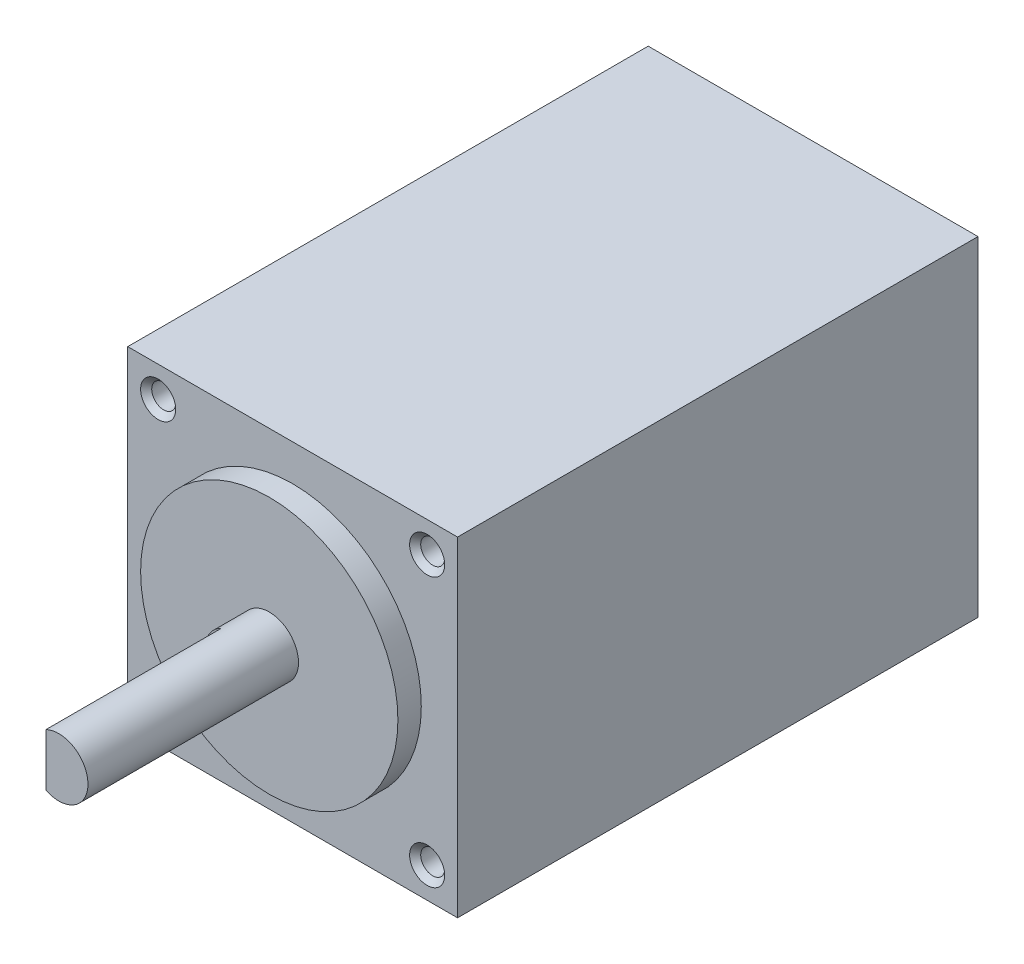
ISO-10303-21;
HEADER;
FILE_DESCRIPTION(('STEP AP214'),'2;1');
FILE_NAME('part.step','',(''),(''),'','','');
FILE_SCHEMA(('AUTOMOTIVE_DESIGN { 1 0 10303 214 1 1 1 1 }'));
ENDSEC;
DATA;
#1=APPLICATION_CONTEXT('core data for automotive mechanical design processes');
#2=APPLICATION_PROTOCOL_DEFINITION('international standard','automotive_design',2000,#1);
#3=PRODUCT_CONTEXT('',#1,'mechanical');
#4=PRODUCT('Part','Part','',(#3));
#5=PRODUCT_RELATED_PRODUCT_CATEGORY('part','',(#4));
#6=PRODUCT_DEFINITION_FORMATION('','',#4);
#7=PRODUCT_DEFINITION_CONTEXT('part definition',#1,'design');
#8=PRODUCT_DEFINITION('design','',#6,#7);
#9=PRODUCT_DEFINITION_SHAPE('','',#8);
#10=(LENGTH_UNIT() NAMED_UNIT(*) SI_UNIT(.MILLI.,.METRE.));
#11=(NAMED_UNIT(*) PLANE_ANGLE_UNIT() SI_UNIT($,.RADIAN.));
#12=(NAMED_UNIT(*) SI_UNIT($,.STERADIAN.) SOLID_ANGLE_UNIT());
#13=UNCERTAINTY_MEASURE_WITH_UNIT(LENGTH_MEASURE(1.E-05),#10,'distance_accuracy_value','');
#14=(GEOMETRIC_REPRESENTATION_CONTEXT(3) GLOBAL_UNCERTAINTY_ASSIGNED_CONTEXT((#13)) GLOBAL_UNIT_ASSIGNED_CONTEXT((#10,
#11,#12)) REPRESENTATION_CONTEXT('',''));
#15=CARTESIAN_POINT('',(0.,0.,0.));
#16=DIRECTION('',(0.,0.,1.));
#17=DIRECTION('',(1.,0.,0.));
#18=AXIS2_PLACEMENT_3D('',#15,#16,#17);
#19=CARTESIAN_POINT('',(0.,0.,44.5));
#20=DIRECTION('',(1.,0.,0.));
#21=DIRECTION('',(0.,0.,-1.));
#22=AXIS2_PLACEMENT_3D('',#19,#20,#21);
#23=PLANE('',#22);
#24=DIRECTION('',(0.,-1.,0.));
#25=VECTOR('',#24,1.);
#26=CARTESIAN_POINT('',(0.,0.,0.));
#27=LINE('',#26,#25);
#28=CARTESIAN_POINT('',(0.,28.2,0.));
#29=VERTEX_POINT('',#28);
#30=CARTESIAN_POINT('',(0.,0.,0.));
#31=VERTEX_POINT('',#30);
#32=EDGE_CURVE('E178',#29,#31,#27,.T.);
#33=ORIENTED_EDGE('',*,*,#32,.T.);
#34=DIRECTION('',(0.,0.,-1.));
#35=VECTOR('',#34,1.);
#36=CARTESIAN_POINT('',(0.,0.,44.5));
#37=LINE('',#36,#35);
#38=CARTESIAN_POINT('',(0.,0.,44.5));
#39=VERTEX_POINT('',#38);
#40=EDGE_CURVE('E48',#39,#31,#37,.T.);
#41=ORIENTED_EDGE('',*,*,#40,.F.);
#42=DIRECTION('',(0.,-1.,0.));
#43=VECTOR('',#42,1.);
#44=CARTESIAN_POINT('',(0.,0.,44.5));
#45=LINE('',#44,#43);
#46=CARTESIAN_POINT('',(0.,28.2,44.5));
#47=VERTEX_POINT('',#46);
#48=EDGE_CURVE('E179',#47,#39,#45,.T.);
#49=ORIENTED_EDGE('',*,*,#48,.F.);
#50=DIRECTION('',(0.,0.,-1.));
#51=VECTOR('',#50,1.);
#52=CARTESIAN_POINT('',(0.,28.2,44.5));
#53=LINE('',#52,#51);
#54=EDGE_CURVE('E185',#47,#29,#53,.T.);
#55=ORIENTED_EDGE('',*,*,#54,.T.);
#56=EDGE_LOOP('',(#33,#41,#49,#55));
#57=FACE_BOUND('',#56,.T.);
#58=ADVANCED_FACE('F41',(#57),#23,.F.);
#59=CARTESIAN_POINT('',(0.,0.,44.5));
#60=DIRECTION('',(0.,1.,0.));
#61=DIRECTION('',(0.,0.,1.));
#62=AXIS2_PLACEMENT_3D('',#59,#60,#61);
#63=PLANE('',#62);
#64=DIRECTION('',(1.,0.,0.));
#65=VECTOR('',#64,1.);
#66=CARTESIAN_POINT('',(0.,0.,0.));
#67=LINE('',#66,#65);
#68=CARTESIAN_POINT('',(28.2,0.,0.));
#69=VERTEX_POINT('',#68);
#70=EDGE_CURVE('E188',#31,#69,#67,.T.);
#71=ORIENTED_EDGE('',*,*,#70,.T.);
#72=DIRECTION('',(0.,0.,-1.));
#73=VECTOR('',#72,1.);
#74=CARTESIAN_POINT('',(28.2,0.,44.5));
#75=LINE('',#74,#73);
#76=CARTESIAN_POINT('',(28.2,0.,44.5));
#77=VERTEX_POINT('',#76);
#78=EDGE_CURVE('E196',#77,#69,#75,.T.);
#79=ORIENTED_EDGE('',*,*,#78,.F.);
#80=DIRECTION('',(1.,0.,0.));
#81=VECTOR('',#80,1.);
#82=CARTESIAN_POINT('',(0.,0.,44.5));
#83=LINE('',#82,#81);
#84=EDGE_CURVE('E93',#39,#77,#83,.T.);
#85=ORIENTED_EDGE('',*,*,#84,.F.);
#86=ORIENTED_EDGE('',*,*,#40,.T.);
#87=EDGE_LOOP('',(#71,#79,#85,#86));
#88=FACE_BOUND('',#87,.T.);
#89=ADVANCED_FACE('F199',(#88),#63,.F.);
#90=CARTESIAN_POINT('',(28.2,0.,44.5));
#91=DIRECTION('',(-1.,0.,0.));
#92=DIRECTION('',(0.,0.,1.));
#93=AXIS2_PLACEMENT_3D('',#90,#91,#92);
#94=PLANE('',#93);
#95=DIRECTION('',(0.,1.,0.));
#96=VECTOR('',#95,1.);
#97=CARTESIAN_POINT('',(28.2,0.,0.));
#98=LINE('',#97,#96);
#99=CARTESIAN_POINT('',(28.2,28.2,0.));
#100=VERTEX_POINT('',#99);
#101=EDGE_CURVE('E190',#69,#100,#98,.T.);
#102=ORIENTED_EDGE('',*,*,#101,.T.);
#103=DIRECTION('',(0.,0.,-1.));
#104=VECTOR('',#103,1.);
#105=CARTESIAN_POINT('',(28.2,28.2,44.5));
#106=LINE('',#105,#104);
#107=CARTESIAN_POINT('',(28.2,28.2,44.5));
#108=VERTEX_POINT('',#107);
#109=EDGE_CURVE('E194',#108,#100,#106,.T.);
#110=ORIENTED_EDGE('',*,*,#109,.F.);
#111=DIRECTION('',(0.,1.,0.));
#112=VECTOR('',#111,1.);
#113=CARTESIAN_POINT('',(28.2,0.,44.5));
#114=LINE('',#113,#112);
#115=EDGE_CURVE('E182',#77,#108,#114,.T.);
#116=ORIENTED_EDGE('',*,*,#115,.F.);
#117=ORIENTED_EDGE('',*,*,#78,.T.);
#118=EDGE_LOOP('',(#102,#110,#116,#117));
#119=FACE_BOUND('',#118,.T.);
#120=ADVANCED_FACE('F208',(#119),#94,.F.);
#121=CARTESIAN_POINT('',(0.,28.2,44.5));
#122=DIRECTION('',(0.,-1.,0.));
#123=DIRECTION('',(1.,0.,0.));
#124=AXIS2_PLACEMENT_3D('',#121,#122,#123);
#125=PLANE('',#124);
#126=DIRECTION('',(-1.,0.,0.));
#127=VECTOR('',#126,1.);
#128=CARTESIAN_POINT('',(0.,28.2,0.));
#129=LINE('',#128,#127);
#130=EDGE_CURVE('E85',#100,#29,#129,.T.);
#131=ORIENTED_EDGE('',*,*,#130,.T.);
#132=ORIENTED_EDGE('',*,*,#54,.F.);
#133=DIRECTION('',(-1.,0.,0.));
#134=VECTOR('',#133,1.);
#135=CARTESIAN_POINT('',(0.,28.2,44.5));
#136=LINE('',#135,#134);
#137=EDGE_CURVE('E64',#108,#47,#136,.T.);
#138=ORIENTED_EDGE('',*,*,#137,.F.);
#139=ORIENTED_EDGE('',*,*,#109,.T.);
#140=EDGE_LOOP('',(#131,#132,#138,#139));
#141=FACE_BOUND('',#140,.T.);
#142=ADVANCED_FACE('F210',(#141),#125,.F.);
#143=CARTESIAN_POINT('',(0.,0.,44.5));
#144=DIRECTION('',(0.,0.,-1.));
#145=DIRECTION('',(-1.,0.,0.));
#146=AXIS2_PLACEMENT_3D('',#143,#144,#145);
#147=PLANE('',#146);
#148=CARTESIAN_POINT('',(14.1,14.1,44.5));
#149=DIRECTION('',(0.,0.,-1.));
#150=DIRECTION('',(-1.,0.,0.));
#151=AXIS2_PLACEMENT_3D('',#148,#149,#150);
#152=CIRCLE('',#151,11.);
#153=CARTESIAN_POINT('',(3.1,14.1,44.5));
#154=VERTEX_POINT('',#153);
#155=EDGE_CURVE('E11',#154,#154,#152,.F.);
#156=ORIENTED_EDGE('',*,*,#155,.F.);
#157=EDGE_LOOP('',(#156));
#158=FACE_BOUND('',#157,.T.);
#159=CARTESIAN_POINT('',(25.5999999999999,25.5999999999999,44.5));
#160=DIRECTION('',(0.,0.,1.));
#161=DIRECTION('',(1.,0.,0.));
#162=AXIS2_PLACEMENT_3D('',#159,#160,#161);
#163=CIRCLE('',#162,1.5);
#164=CARTESIAN_POINT('',(27.0999999999999,25.5999999999999,44.5));
#165=VERTEX_POINT('',#164);
#166=EDGE_CURVE('E142',#165,#165,#163,.T.);
#167=ORIENTED_EDGE('',*,*,#166,.F.);
#168=EDGE_LOOP('',(#167));
#169=FACE_BOUND('',#168,.T.);
#170=CARTESIAN_POINT('',(2.59999999999988,2.59999999999988,44.5));
#171=DIRECTION('',(0.,0.,1.));
#172=DIRECTION('',(1.,0.,0.));
#173=AXIS2_PLACEMENT_3D('',#170,#171,#172);
#174=CIRCLE('',#173,1.5);
#175=CARTESIAN_POINT('',(4.09999999999988,2.59999999999988,44.5));
#176=VERTEX_POINT('',#175);
#177=EDGE_CURVE('E151',#176,#176,#174,.T.);
#178=ORIENTED_EDGE('',*,*,#177,.F.);
#179=EDGE_LOOP('',(#178));
#180=FACE_BOUND('',#179,.T.);
#181=CARTESIAN_POINT('',(2.59999999999988,25.5999999999999,44.5));
#182=DIRECTION('',(0.,0.,1.));
#183=DIRECTION('',(1.,0.,0.));
#184=AXIS2_PLACEMENT_3D('',#181,#182,#183);
#185=CIRCLE('',#184,1.5);
#186=CARTESIAN_POINT('',(4.09999999999988,25.5999999999999,44.5));
#187=VERTEX_POINT('',#186);
#188=EDGE_CURVE('E160',#187,#187,#185,.T.);
#189=ORIENTED_EDGE('',*,*,#188,.F.);
#190=EDGE_LOOP('',(#189));
#191=FACE_BOUND('',#190,.T.);
#192=CARTESIAN_POINT('',(25.5999999999999,2.59999999999988,44.5));
#193=DIRECTION('',(0.,0.,1.));
#194=DIRECTION('',(1.,0.,0.));
#195=AXIS2_PLACEMENT_3D('',#192,#193,#194);
#196=CIRCLE('',#195,1.5);
#197=CARTESIAN_POINT('',(27.0999999999999,2.59999999999988,44.5));
#198=VERTEX_POINT('',#197);
#199=EDGE_CURVE('E169',#198,#198,#196,.T.);
#200=ORIENTED_EDGE('',*,*,#199,.F.);
#201=EDGE_LOOP('',(#200));
#202=FACE_BOUND('',#201,.T.);
#203=ORIENTED_EDGE('',*,*,#48,.T.);
#204=ORIENTED_EDGE('',*,*,#84,.T.);
#205=ORIENTED_EDGE('',*,*,#115,.T.);
#206=ORIENTED_EDGE('',*,*,#137,.T.);
#207=EDGE_LOOP('',(#203,#204,#205,#206));
#208=FACE_BOUND('',#207,.T.);
#209=ADVANCED_FACE('F211',(#158,#169,#180,#191,#202,#208),#147,.F.);
#210=CARTESIAN_POINT('',(0.,0.,0.));
#211=DIRECTION('',(0.,0.,-1.));
#212=DIRECTION('',(-1.,0.,0.));
#213=AXIS2_PLACEMENT_3D('',#210,#211,#212);
#214=PLANE('',#213);
#215=ORIENTED_EDGE('',*,*,#32,.F.);
#216=ORIENTED_EDGE('',*,*,#130,.F.);
#217=ORIENTED_EDGE('',*,*,#101,.F.);
#218=ORIENTED_EDGE('',*,*,#70,.F.);
#219=EDGE_LOOP('',(#215,#216,#217,#218));
#220=FACE_BOUND('',#219,.T.);
#221=ADVANCED_FACE('F204',(#220),#214,.T.);
#222=CARTESIAN_POINT('',(25.5999999999999,2.59999999999988,38.1));
#223=DIRECTION('',(0.,0.,1.));
#224=DIRECTION('',(1.,0.,0.));
#225=AXIS2_PLACEMENT_3D('',#222,#223,#224);
#226=CONICAL_SURFACE('',#225,1.02499999999998,1.02974425867664);
#227=CARTESIAN_POINT('',(25.5999999999999,2.59999999999988,37.4841178654967));
#228=VERTEX_POINT('',#227);
#229=VERTEX_LOOP('',#228);
#230=FACE_BOUND('',#229,.T.);
#231=CARTESIAN_POINT('',(25.5999999999999,2.59999999999988,38.1));
#232=DIRECTION('',(0.,0.,1.));
#233=DIRECTION('',(1.,0.,0.));
#234=AXIS2_PLACEMENT_3D('',#231,#232,#233);
#235=CIRCLE('',#234,1.02499999999998);
#236=CARTESIAN_POINT('',(26.6249999999999,2.59999999999988,38.1));
#237=VERTEX_POINT('',#236);
#238=EDGE_CURVE('E175',#237,#237,#235,.T.);
#239=ORIENTED_EDGE('',*,*,#238,.T.);
#240=EDGE_LOOP('',(#239));
#241=FACE_BOUND('',#240,.T.);
#242=ADVANCED_FACE('F220',(#230,#241),#226,.F.);
#243=CARTESIAN_POINT('',(25.5999999999999,2.59999999999988,44.5));
#244=DIRECTION('',(0.,0.,1.));
#245=DIRECTION('',(1.,0.,0.));
#246=AXIS2_PLACEMENT_3D('',#243,#244,#245);
#247=CYLINDRICAL_SURFACE('',#246,1.02499999999999);
#248=ORIENTED_EDGE('',*,*,#238,.F.);
#249=EDGE_LOOP('',(#248));
#250=FACE_BOUND('',#249,.T.);
#251=CARTESIAN_POINT('',(25.5999999999999,2.59999999999988,44.025));
#252=DIRECTION('',(0.,0.,1.));
#253=DIRECTION('',(1.,0.,0.));
#254=AXIS2_PLACEMENT_3D('',#251,#252,#253);
#255=CIRCLE('',#254,1.025);
#256=CARTESIAN_POINT('',(26.6249999999999,2.59999999999988,44.025));
#257=VERTEX_POINT('',#256);
#258=EDGE_CURVE('E172',#257,#257,#255,.T.);
#259=ORIENTED_EDGE('',*,*,#258,.T.);
#260=EDGE_LOOP('',(#259));
#261=FACE_BOUND('',#260,.T.);
#262=ADVANCED_FACE('F268',(#250,#261),#247,.F.);
#263=CARTESIAN_POINT('',(25.5999999999999,2.59999999999988,44.5));
#264=DIRECTION('',(0.,0.,1.));
#265=DIRECTION('',(1.,0.,0.));
#266=AXIS2_PLACEMENT_3D('',#263,#264,#265);
#267=CONICAL_SURFACE('',#266,1.5,0.785398163397448);
#268=ORIENTED_EDGE('',*,*,#258,.F.);
#269=EDGE_LOOP('',(#268));
#270=FACE_BOUND('',#269,.T.);
#271=ORIENTED_EDGE('',*,*,#199,.T.);
#272=EDGE_LOOP('',(#271));
#273=FACE_BOUND('',#272,.T.);
#274=ADVANCED_FACE('F263',(#270,#273),#267,.F.);
#275=CARTESIAN_POINT('',(2.59999999999988,25.5999999999999,38.1));
#276=DIRECTION('',(0.,0.,1.));
#277=DIRECTION('',(1.,0.,0.));
#278=AXIS2_PLACEMENT_3D('',#275,#276,#277);
#279=CONICAL_SURFACE('',#278,1.02499999999998,1.02974425867664);
#280=CARTESIAN_POINT('',(2.59999999999988,25.5999999999999,37.4841178654967));
#281=VERTEX_POINT('',#280);
#282=VERTEX_LOOP('',#281);
#283=FACE_BOUND('',#282,.T.);
#284=CARTESIAN_POINT('',(2.59999999999988,25.5999999999999,38.1));
#285=DIRECTION('',(0.,0.,1.));
#286=DIRECTION('',(1.,0.,0.));
#287=AXIS2_PLACEMENT_3D('',#284,#285,#286);
#288=CIRCLE('',#287,1.02499999999998);
#289=CARTESIAN_POINT('',(3.62499999999986,25.5999999999999,38.1));
#290=VERTEX_POINT('',#289);
#291=EDGE_CURVE('E166',#290,#290,#288,.T.);
#292=ORIENTED_EDGE('',*,*,#291,.T.);
#293=EDGE_LOOP('',(#292));
#294=FACE_BOUND('',#293,.T.);
#295=ADVANCED_FACE('F267',(#283,#294),#279,.F.);
#296=CARTESIAN_POINT('',(2.59999999999988,25.5999999999999,44.5));
#297=DIRECTION('',(0.,0.,1.));
#298=DIRECTION('',(1.,0.,0.));
#299=AXIS2_PLACEMENT_3D('',#296,#297,#298);
#300=CYLINDRICAL_SURFACE('',#299,1.02499999999999);
#301=ORIENTED_EDGE('',*,*,#291,.F.);
#302=EDGE_LOOP('',(#301));
#303=FACE_BOUND('',#302,.T.);
#304=CARTESIAN_POINT('',(2.59999999999988,25.5999999999999,44.025));
#305=DIRECTION('',(0.,0.,1.));
#306=DIRECTION('',(1.,0.,0.));
#307=AXIS2_PLACEMENT_3D('',#304,#305,#306);
#308=CIRCLE('',#307,1.025);
#309=CARTESIAN_POINT('',(3.62499999999988,25.5999999999999,44.025));
#310=VERTEX_POINT('',#309);
#311=EDGE_CURVE('E163',#310,#310,#308,.T.);
#312=ORIENTED_EDGE('',*,*,#311,.T.);
#313=EDGE_LOOP('',(#312));
#314=FACE_BOUND('',#313,.T.);
#315=ADVANCED_FACE('F292',(#303,#314),#300,.F.);
#316=CARTESIAN_POINT('',(2.59999999999988,25.5999999999999,44.5));
#317=DIRECTION('',(0.,0.,1.));
#318=DIRECTION('',(1.,0.,0.));
#319=AXIS2_PLACEMENT_3D('',#316,#317,#318);
#320=CONICAL_SURFACE('',#319,1.5,0.785398163397446);
#321=ORIENTED_EDGE('',*,*,#311,.F.);
#322=EDGE_LOOP('',(#321));
#323=FACE_BOUND('',#322,.T.);
#324=ORIENTED_EDGE('',*,*,#188,.T.);
#325=EDGE_LOOP('',(#324));
#326=FACE_BOUND('',#325,.T.);
#327=ADVANCED_FACE('F287',(#323,#326),#320,.F.);
#328=CARTESIAN_POINT('',(2.59999999999988,2.59999999999988,38.1));
#329=DIRECTION('',(0.,0.,1.));
#330=DIRECTION('',(1.,0.,0.));
#331=AXIS2_PLACEMENT_3D('',#328,#329,#330);
#332=CONICAL_SURFACE('',#331,1.02499999999998,1.02974425867664);
#333=CARTESIAN_POINT('',(2.59999999999988,2.59999999999988,37.4841178654967));
#334=VERTEX_POINT('',#333);
#335=VERTEX_LOOP('',#334);
#336=FACE_BOUND('',#335,.T.);
#337=CARTESIAN_POINT('',(2.59999999999988,2.59999999999988,38.1));
#338=DIRECTION('',(0.,0.,1.));
#339=DIRECTION('',(1.,0.,0.));
#340=AXIS2_PLACEMENT_3D('',#337,#338,#339);
#341=CIRCLE('',#340,1.02499999999998);
#342=CARTESIAN_POINT('',(3.62499999999986,2.59999999999988,38.1));
#343=VERTEX_POINT('',#342);
#344=EDGE_CURVE('E157',#343,#343,#341,.T.);
#345=ORIENTED_EDGE('',*,*,#344,.T.);
#346=EDGE_LOOP('',(#345));
#347=FACE_BOUND('',#346,.T.);
#348=ADVANCED_FACE('F291',(#336,#347),#332,.F.);
#349=CARTESIAN_POINT('',(2.59999999999988,2.59999999999988,44.5));
#350=DIRECTION('',(0.,0.,1.));
#351=DIRECTION('',(1.,0.,0.));
#352=AXIS2_PLACEMENT_3D('',#349,#350,#351);
#353=CYLINDRICAL_SURFACE('',#352,1.02499999999999);
#354=ORIENTED_EDGE('',*,*,#344,.F.);
#355=EDGE_LOOP('',(#354));
#356=FACE_BOUND('',#355,.T.);
#357=CARTESIAN_POINT('',(2.59999999999988,2.59999999999988,44.025));
#358=DIRECTION('',(0.,0.,1.));
#359=DIRECTION('',(1.,0.,0.));
#360=AXIS2_PLACEMENT_3D('',#357,#358,#359);
#361=CIRCLE('',#360,1.025);
#362=CARTESIAN_POINT('',(3.62499999999988,2.59999999999988,44.025));
#363=VERTEX_POINT('',#362);
#364=EDGE_CURVE('E154',#363,#363,#361,.T.);
#365=ORIENTED_EDGE('',*,*,#364,.T.);
#366=EDGE_LOOP('',(#365));
#367=FACE_BOUND('',#366,.T.);
#368=ADVANCED_FACE('F256',(#356,#367),#353,.F.);
#369=CARTESIAN_POINT('',(2.59999999999988,2.59999999999988,44.5));
#370=DIRECTION('',(0.,0.,1.));
#371=DIRECTION('',(1.,0.,0.));
#372=AXIS2_PLACEMENT_3D('',#369,#370,#371);
#373=CONICAL_SURFACE('',#372,1.5,0.785398163397446);
#374=ORIENTED_EDGE('',*,*,#364,.F.);
#375=EDGE_LOOP('',(#374));
#376=FACE_BOUND('',#375,.T.);
#377=ORIENTED_EDGE('',*,*,#177,.T.);
#378=EDGE_LOOP('',(#377));
#379=FACE_BOUND('',#378,.T.);
#380=ADVANCED_FACE('F251',(#376,#379),#373,.F.);
#381=CARTESIAN_POINT('',(25.5999999999999,25.5999999999999,38.1));
#382=DIRECTION('',(0.,0.,1.));
#383=DIRECTION('',(1.,0.,0.));
#384=AXIS2_PLACEMENT_3D('',#381,#382,#383);
#385=CONICAL_SURFACE('',#384,1.02499999999998,1.02974425867664);
#386=CARTESIAN_POINT('',(25.5999999999999,25.5999999999999,37.4841178654967));
#387=VERTEX_POINT('',#386);
#388=VERTEX_LOOP('',#387);
#389=FACE_BOUND('',#388,.T.);
#390=CARTESIAN_POINT('',(25.5999999999999,25.5999999999999,38.1));
#391=DIRECTION('',(0.,0.,1.));
#392=DIRECTION('',(1.,0.,0.));
#393=AXIS2_PLACEMENT_3D('',#390,#391,#392);
#394=CIRCLE('',#393,1.02499999999998);
#395=CARTESIAN_POINT('',(26.6249999999999,25.5999999999999,38.1));
#396=VERTEX_POINT('',#395);
#397=EDGE_CURVE('E148',#396,#396,#394,.T.);
#398=ORIENTED_EDGE('',*,*,#397,.T.);
#399=EDGE_LOOP('',(#398));
#400=FACE_BOUND('',#399,.T.);
#401=ADVANCED_FACE('F255',(#389,#400),#385,.F.);
#402=CARTESIAN_POINT('',(25.5999999999999,25.5999999999999,44.5));
#403=DIRECTION('',(0.,0.,1.));
#404=DIRECTION('',(1.,0.,0.));
#405=AXIS2_PLACEMENT_3D('',#402,#403,#404);
#406=CYLINDRICAL_SURFACE('',#405,1.02499999999999);
#407=ORIENTED_EDGE('',*,*,#397,.F.);
#408=EDGE_LOOP('',(#407));
#409=FACE_BOUND('',#408,.T.);
#410=CARTESIAN_POINT('',(25.5999999999999,25.5999999999999,44.025));
#411=DIRECTION('',(0.,0.,1.));
#412=DIRECTION('',(1.,0.,0.));
#413=AXIS2_PLACEMENT_3D('',#410,#411,#412);
#414=CIRCLE('',#413,1.025);
#415=CARTESIAN_POINT('',(26.6249999999999,25.5999999999999,44.025));
#416=VERTEX_POINT('',#415);
#417=EDGE_CURVE('E145',#416,#416,#414,.T.);
#418=ORIENTED_EDGE('',*,*,#417,.T.);
#419=EDGE_LOOP('',(#418));
#420=FACE_BOUND('',#419,.T.);
#421=ADVANCED_FACE('F280',(#409,#420),#406,.F.);
#422=CARTESIAN_POINT('',(25.5999999999999,25.5999999999999,44.5));
#423=DIRECTION('',(0.,0.,1.));
#424=DIRECTION('',(1.,0.,0.));
#425=AXIS2_PLACEMENT_3D('',#422,#423,#424);
#426=CONICAL_SURFACE('',#425,1.5,0.785398163397448);
#427=ORIENTED_EDGE('',*,*,#417,.F.);
#428=EDGE_LOOP('',(#427));
#429=FACE_BOUND('',#428,.T.);
#430=ORIENTED_EDGE('',*,*,#166,.T.);
#431=EDGE_LOOP('',(#430));
#432=FACE_BOUND('',#431,.T.);
#433=ADVANCED_FACE('F275',(#429,#432),#426,.F.);
#434=CARTESIAN_POINT('',(14.1,14.1,46.5));
#435=DIRECTION('',(0.,0.,-1.));
#436=DIRECTION('',(-1.,0.,0.));
#437=AXIS2_PLACEMENT_3D('',#434,#435,#436);
#438=CYLINDRICAL_SURFACE('',#437,11.);
#439=CARTESIAN_POINT('',(14.1,14.1,46.5));
#440=DIRECTION('',(0.,0.,1.));
#441=DIRECTION('',(1.,0.,0.));
#442=AXIS2_PLACEMENT_3D('',#439,#440,#441);
#443=CIRCLE('',#442,11.);
#444=CARTESIAN_POINT('',(25.1,14.1,46.5));
#445=VERTEX_POINT('',#444);
#446=EDGE_CURVE('E137',#445,#445,#443,.T.);
#447=ORIENTED_EDGE('',*,*,#446,.F.);
#448=EDGE_LOOP('',(#447));
#449=FACE_BOUND('',#448,.T.);
#450=ORIENTED_EDGE('',*,*,#155,.T.);
#451=EDGE_LOOP('',(#450));
#452=FACE_BOUND('',#451,.T.);
#453=ADVANCED_FACE('F279',(#449,#452),#438,.T.);
#454=CARTESIAN_POINT('',(14.1,14.1,46.5));
#455=DIRECTION('',(0.,0.,1.));
#456=DIRECTION('',(1.,0.,0.));
#457=AXIS2_PLACEMENT_3D('',#454,#455,#456);
#458=PLANE('',#457);
#459=CARTESIAN_POINT('',(14.1,14.1,46.5));
#460=DIRECTION('',(0.,0.,1.));
#461=DIRECTION('',(1.,0.,0.));
#462=AXIS2_PLACEMENT_3D('',#459,#460,#461);
#463=CIRCLE('',#462,2.5);
#464=CARTESIAN_POINT('',(16.6,14.1,46.5));
#465=VERTEX_POINT('',#464);
#466=EDGE_CURVE('E132',#465,#465,#463,.T.);
#467=ORIENTED_EDGE('',*,*,#466,.F.);
#468=EDGE_LOOP('',(#467));
#469=FACE_BOUND('',#468,.T.);
#470=ORIENTED_EDGE('',*,*,#446,.T.);
#471=EDGE_LOOP('',(#470));
#472=FACE_BOUND('',#471,.T.);
#473=ADVANCED_FACE('F323',(#469,#472),#458,.T.);
#474=CARTESIAN_POINT('',(14.1,14.1,64.5));
#475=DIRECTION('',(0.,0.,-1.));
#476=DIRECTION('',(-1.,0.,0.));
#477=AXIS2_PLACEMENT_3D('',#474,#475,#476);
#478=CYLINDRICAL_SURFACE('',#477,2.5);
#479=CARTESIAN_POINT('',(14.1,14.1,64.5));
#480=DIRECTION('',(0.,0.,1.));
#481=DIRECTION('',(1.,0.,0.));
#482=AXIS2_PLACEMENT_3D('',#479,#480,#481);
#483=CIRCLE('',#482,2.5);
#484=CARTESIAN_POINT('',(13.0102752641148,11.85,64.5));
#485=VERTEX_POINT('',#484);
#486=CARTESIAN_POINT('',(13.0102752641148,16.35,64.5));
#487=VERTEX_POINT('',#486);
#488=EDGE_CURVE('E130',#485,#487,#483,.T.);
#489=ORIENTED_EDGE('',*,*,#488,.F.);
#490=DIRECTION('',(0.,0.,1.));
#491=VECTOR('',#490,1.);
#492=CARTESIAN_POINT('',(13.0102752641148,11.85,49.5));
#493=LINE('',#492,#491);
#494=CARTESIAN_POINT('',(13.0102752641148,11.85,49.5));
#495=VERTEX_POINT('',#494);
#496=EDGE_CURVE('E55',#495,#485,#493,.T.);
#497=ORIENTED_EDGE('',*,*,#496,.F.);
#498=CARTESIAN_POINT('',(14.1,14.1,49.5));
#499=DIRECTION('',(0.,0.,1.));
#500=DIRECTION('',(1.,0.,0.));
#501=AXIS2_PLACEMENT_3D('',#498,#499,#500);
#502=CIRCLE('',#501,2.5);
#503=CARTESIAN_POINT('',(13.0102752641148,16.35,49.5));
#504=VERTEX_POINT('',#503);
#505=EDGE_CURVE('E116',#504,#495,#502,.T.);
#506=ORIENTED_EDGE('',*,*,#505,.F.);
#507=DIRECTION('',(0.,0.,1.));
#508=VECTOR('',#507,1.);
#509=CARTESIAN_POINT('',(13.0102752641148,16.35,49.5));
#510=LINE('',#509,#508);
#511=EDGE_CURVE('E124',#504,#487,#510,.T.);
#512=ORIENTED_EDGE('',*,*,#511,.T.);
#513=EDGE_LOOP('',(#489,#497,#506,#512));
#514=FACE_BOUND('',#513,.T.);
#515=ORIENTED_EDGE('',*,*,#466,.T.);
#516=EDGE_LOOP('',(#515));
#517=FACE_BOUND('',#516,.T.);
#518=ADVANCED_FACE('F127',(#514,#517),#478,.T.);
#519=CARTESIAN_POINT('',(14.1,14.1,64.5));
#520=DIRECTION('',(0.,0.,1.));
#521=DIRECTION('',(1.,0.,0.));
#522=AXIS2_PLACEMENT_3D('',#519,#520,#521);
#523=PLANE('',#522);
#524=DIRECTION('',(0.,1.,0.));
#525=VECTOR('',#524,1.);
#526=CARTESIAN_POINT('',(13.0102752641148,16.35,64.5));
#527=LINE('',#526,#525);
#528=EDGE_CURVE('E121',#485,#487,#527,.T.);
#529=ORIENTED_EDGE('',*,*,#528,.F.);
#530=ORIENTED_EDGE('',*,*,#488,.T.);
#531=EDGE_LOOP('',(#529,#530));
#532=FACE_BOUND('',#531,.T.);
#533=ADVANCED_FACE('F340',(#532),#523,.T.);
#534=CARTESIAN_POINT('',(13.0102752641148,16.35,49.5));
#535=DIRECTION('',(1.,0.,0.));
#536=DIRECTION('',(0.,0.,-1.));
#537=AXIS2_PLACEMENT_3D('',#534,#535,#536);
#538=PLANE('',#537);
#539=ORIENTED_EDGE('',*,*,#528,.T.);
#540=ORIENTED_EDGE('',*,*,#511,.F.);
#541=DIRECTION('',(0.,1.,0.));
#542=VECTOR('',#541,1.);
#543=CARTESIAN_POINT('',(13.0102752641148,16.35,49.5));
#544=LINE('',#543,#542);
#545=EDGE_CURVE('E118',#495,#504,#544,.T.);
#546=ORIENTED_EDGE('',*,*,#545,.F.);
#547=ORIENTED_EDGE('',*,*,#496,.T.);
#548=EDGE_LOOP('',(#539,#540,#546,#547));
#549=FACE_BOUND('',#548,.T.);
#550=ADVANCED_FACE('F123',(#549),#538,.F.);
#551=CARTESIAN_POINT('',(14.1,14.1,49.5));
#552=DIRECTION('',(0.,0.,1.));
#553=DIRECTION('',(1.,0.,0.));
#554=AXIS2_PLACEMENT_3D('',#551,#552,#553);
#555=PLANE('',#554);
#556=ORIENTED_EDGE('',*,*,#505,.T.);
#557=ORIENTED_EDGE('',*,*,#545,.T.);
#558=EDGE_LOOP('',(#556,#557));
#559=FACE_BOUND('',#558,.T.);
#560=ADVANCED_FACE('F117',(#559),#555,.T.);
#561=CLOSED_SHELL('',(#58,#89,#120,#142,#209,#221,#242,#262,#274,#295,#315,#327,#348,#368,#380,
#401,#421,#433,#453,#473,#518,#533,#550,#560));
#562=MANIFOLD_SOLID_BREP('B2',#561);
#563=ADVANCED_BREP_SHAPE_REPRESENTATION('',(#18,#562),#14);
#564=SHAPE_DEFINITION_REPRESENTATION(#9,#563);
ENDSEC;
END-ISO-10303-21;
